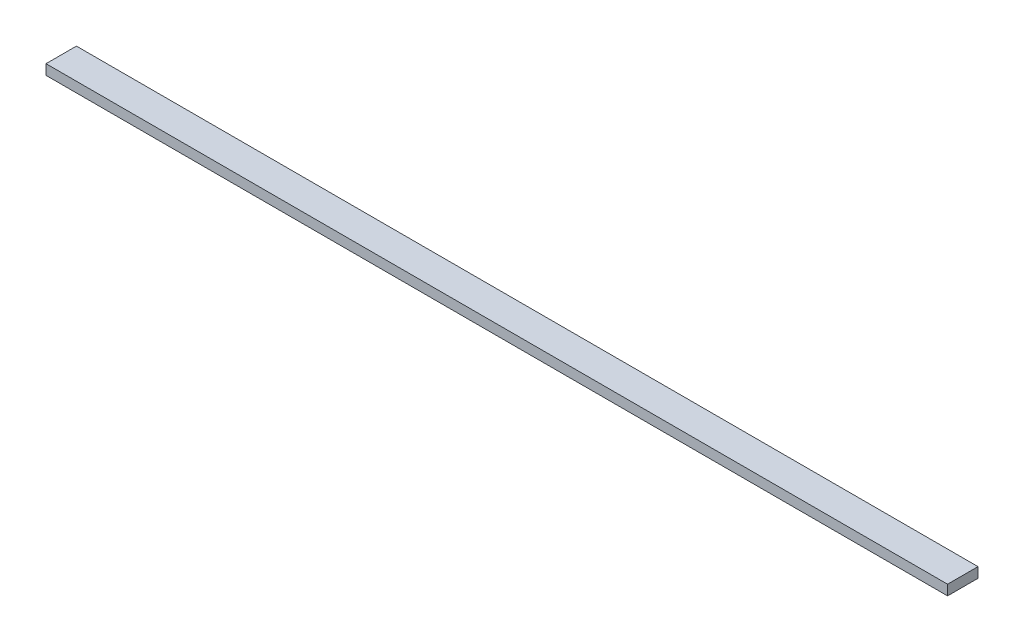
ISO-10303-21;
HEADER;
FILE_DESCRIPTION(('STEP AP214'),'2;1');
FILE_NAME('part.step','',(''),(''),'','','');
FILE_SCHEMA(('AUTOMOTIVE_DESIGN { 1 0 10303 214 1 1 1 1 }'));
ENDSEC;
DATA;
#1=APPLICATION_CONTEXT('core data for automotive mechanical design processes');
#2=APPLICATION_PROTOCOL_DEFINITION('international standard','automotive_design',2000,#1);
#3=PRODUCT_CONTEXT('',#1,'mechanical');
#4=PRODUCT('Part','Part','',(#3));
#5=PRODUCT_RELATED_PRODUCT_CATEGORY('part','',(#4));
#6=PRODUCT_DEFINITION_FORMATION('','',#4);
#7=PRODUCT_DEFINITION_CONTEXT('part definition',#1,'design');
#8=PRODUCT_DEFINITION('design','',#6,#7);
#9=PRODUCT_DEFINITION_SHAPE('','',#8);
#10=(LENGTH_UNIT() NAMED_UNIT(*) SI_UNIT(.MILLI.,.METRE.));
#11=(NAMED_UNIT(*) PLANE_ANGLE_UNIT() SI_UNIT($,.RADIAN.));
#12=(NAMED_UNIT(*) SI_UNIT($,.STERADIAN.) SOLID_ANGLE_UNIT());
#13=UNCERTAINTY_MEASURE_WITH_UNIT(LENGTH_MEASURE(1.E-05),#10,'distance_accuracy_value','');
#14=(GEOMETRIC_REPRESENTATION_CONTEXT(3) GLOBAL_UNCERTAINTY_ASSIGNED_CONTEXT((#13)) GLOBAL_UNIT_ASSIGNED_CONTEXT((#10,
#11,#12)) REPRESENTATION_CONTEXT('',''));
#15=CARTESIAN_POINT('',(0.,0.,0.));
#16=DIRECTION('',(0.,0.,1.));
#17=DIRECTION('',(1.,0.,0.));
#18=AXIS2_PLACEMENT_3D('',#15,#16,#17);
#19=CARTESIAN_POINT('',(-444.265,10.,-15.));
#20=DIRECTION('',(1.,0.,0.));
#21=DIRECTION('',(0.,0.,-1.));
#22=AXIS2_PLACEMENT_3D('',#19,#20,#21);
#23=PLANE('',#22);
#24=DIRECTION('',(0.,0.,1.));
#25=VECTOR('',#24,1.);
#26=CARTESIAN_POINT('',(-444.265,0.,-15.));
#27=LINE('',#26,#25);
#28=CARTESIAN_POINT('',(-444.265,0.,-15.));
#29=VERTEX_POINT('',#28);
#30=CARTESIAN_POINT('',(-444.265,0.,15.));
#31=VERTEX_POINT('',#30);
#32=EDGE_CURVE('E95',#29,#31,#27,.T.);
#33=ORIENTED_EDGE('',*,*,#32,.T.);
#34=DIRECTION('',(0.,-1.,0.));
#35=VECTOR('',#34,1.);
#36=CARTESIAN_POINT('',(-444.265,10.,15.));
#37=LINE('',#36,#35);
#38=CARTESIAN_POINT('',(-444.265,10.,15.));
#39=VERTEX_POINT('',#38);
#40=EDGE_CURVE('E11',#39,#31,#37,.T.);
#41=ORIENTED_EDGE('',*,*,#40,.F.);
#42=DIRECTION('',(0.,0.,1.));
#43=VECTOR('',#42,1.);
#44=CARTESIAN_POINT('',(-444.265,10.,-15.));
#45=LINE('',#44,#43);
#46=CARTESIAN_POINT('',(-444.265,10.,-15.));
#47=VERTEX_POINT('',#46);
#48=EDGE_CURVE('E83',#47,#39,#45,.T.);
#49=ORIENTED_EDGE('',*,*,#48,.F.);
#50=DIRECTION('',(0.,-1.,0.));
#51=VECTOR('',#50,1.);
#52=CARTESIAN_POINT('',(-444.265,10.,-15.));
#53=LINE('',#52,#51);
#54=EDGE_CURVE('E91',#47,#29,#53,.T.);
#55=ORIENTED_EDGE('',*,*,#54,.T.);
#56=EDGE_LOOP('',(#33,#41,#49,#55));
#57=FACE_BOUND('',#56,.T.);
#58=ADVANCED_FACE('F32',(#57),#23,.F.);
#59=CARTESIAN_POINT('',(-444.265,10.,15.));
#60=DIRECTION('',(0.,0.,-1.));
#61=DIRECTION('',(-1.,0.,0.));
#62=AXIS2_PLACEMENT_3D('',#59,#60,#61);
#63=PLANE('',#62);
#64=DIRECTION('',(1.,0.,0.));
#65=VECTOR('',#64,1.);
#66=CARTESIAN_POINT('',(-444.265,0.,15.));
#67=LINE('',#66,#65);
#68=CARTESIAN_POINT('',(444.265,0.,15.));
#69=VERTEX_POINT('',#68);
#70=EDGE_CURVE('E87',#31,#69,#67,.T.);
#71=ORIENTED_EDGE('',*,*,#70,.T.);
#72=DIRECTION('',(0.,-1.,0.));
#73=VECTOR('',#72,1.);
#74=CARTESIAN_POINT('',(444.265,10.,15.));
#75=LINE('',#74,#73);
#76=CARTESIAN_POINT('',(444.265,10.,15.));
#77=VERTEX_POINT('',#76);
#78=EDGE_CURVE('E40',#77,#69,#75,.T.);
#79=ORIENTED_EDGE('',*,*,#78,.F.);
#80=DIRECTION('',(1.,0.,0.));
#81=VECTOR('',#80,1.);
#82=CARTESIAN_POINT('',(-444.265,10.,15.));
#83=LINE('',#82,#81);
#84=EDGE_CURVE('E78',#39,#77,#83,.T.);
#85=ORIENTED_EDGE('',*,*,#84,.F.);
#86=ORIENTED_EDGE('',*,*,#40,.T.);
#87=EDGE_LOOP('',(#71,#79,#85,#86));
#88=FACE_BOUND('',#87,.T.);
#89=ADVANCED_FACE('F86',(#88),#63,.F.);
#90=CARTESIAN_POINT('',(444.265,10.,-15.));
#91=DIRECTION('',(-1.,0.,0.));
#92=DIRECTION('',(0.,0.,1.));
#93=AXIS2_PLACEMENT_3D('',#90,#91,#92);
#94=PLANE('',#93);
#95=DIRECTION('',(0.,0.,-1.));
#96=VECTOR('',#95,1.);
#97=CARTESIAN_POINT('',(444.265,0.,-15.));
#98=LINE('',#97,#96);
#99=CARTESIAN_POINT('',(444.265,0.,-15.));
#100=VERTEX_POINT('',#99);
#101=EDGE_CURVE('E65',#69,#100,#98,.T.);
#102=ORIENTED_EDGE('',*,*,#101,.T.);
#103=DIRECTION('',(0.,-1.,0.));
#104=VECTOR('',#103,1.);
#105=CARTESIAN_POINT('',(444.265,10.,-15.));
#106=LINE('',#105,#104);
#107=CARTESIAN_POINT('',(444.265,10.,-15.));
#108=VERTEX_POINT('',#107);
#109=EDGE_CURVE('E88',#108,#100,#106,.T.);
#110=ORIENTED_EDGE('',*,*,#109,.F.);
#111=DIRECTION('',(0.,0.,-1.));
#112=VECTOR('',#111,1.);
#113=CARTESIAN_POINT('',(444.265,10.,-15.));
#114=LINE('',#113,#112);
#115=EDGE_CURVE('E81',#77,#108,#114,.T.);
#116=ORIENTED_EDGE('',*,*,#115,.F.);
#117=ORIENTED_EDGE('',*,*,#78,.T.);
#118=EDGE_LOOP('',(#102,#110,#116,#117));
#119=FACE_BOUND('',#118,.T.);
#120=ADVANCED_FACE('F89',(#119),#94,.F.);
#121=CARTESIAN_POINT('',(-444.265,10.,-15.));
#122=DIRECTION('',(0.,0.,1.));
#123=DIRECTION('',(1.,0.,0.));
#124=AXIS2_PLACEMENT_3D('',#121,#122,#123);
#125=PLANE('',#124);
#126=DIRECTION('',(-1.,0.,0.));
#127=VECTOR('',#126,1.);
#128=CARTESIAN_POINT('',(-444.265,0.,-15.));
#129=LINE('',#128,#127);
#130=EDGE_CURVE('E71',#100,#29,#129,.T.);
#131=ORIENTED_EDGE('',*,*,#130,.T.);
#132=ORIENTED_EDGE('',*,*,#54,.F.);
#133=DIRECTION('',(-1.,0.,0.));
#134=VECTOR('',#133,1.);
#135=CARTESIAN_POINT('',(-444.265,10.,-15.));
#136=LINE('',#135,#134);
#137=EDGE_CURVE('E48',#108,#47,#136,.T.);
#138=ORIENTED_EDGE('',*,*,#137,.F.);
#139=ORIENTED_EDGE('',*,*,#109,.T.);
#140=EDGE_LOOP('',(#131,#132,#138,#139));
#141=FACE_BOUND('',#140,.T.);
#142=ADVANCED_FACE('F102',(#141),#125,.F.);
#143=CARTESIAN_POINT('',(0.,10.,0.));
#144=DIRECTION('',(0.,1.,0.));
#145=DIRECTION('',(0.,0.,1.));
#146=AXIS2_PLACEMENT_3D('',#143,#144,#145);
#147=PLANE('',#146);
#148=ORIENTED_EDGE('',*,*,#48,.T.);
#149=ORIENTED_EDGE('',*,*,#84,.T.);
#150=ORIENTED_EDGE('',*,*,#115,.T.);
#151=ORIENTED_EDGE('',*,*,#137,.T.);
#152=EDGE_LOOP('',(#148,#149,#150,#151));
#153=FACE_BOUND('',#152,.T.);
#154=ADVANCED_FACE('F79',(#153),#147,.T.);
#155=CARTESIAN_POINT('',(0.,0.,0.));
#156=DIRECTION('',(0.,1.,0.));
#157=DIRECTION('',(0.,0.,1.));
#158=AXIS2_PLACEMENT_3D('',#155,#156,#157);
#159=PLANE('',#158);
#160=ORIENTED_EDGE('',*,*,#32,.F.);
#161=ORIENTED_EDGE('',*,*,#130,.F.);
#162=ORIENTED_EDGE('',*,*,#101,.F.);
#163=ORIENTED_EDGE('',*,*,#70,.F.);
#164=EDGE_LOOP('',(#160,#161,#162,#163));
#165=FACE_BOUND('',#164,.T.);
#166=ADVANCED_FACE('F105',(#165),#159,.F.);
#167=CLOSED_SHELL('',(#58,#89,#120,#142,#154,#166));
#168=MANIFOLD_SOLID_BREP('B2',#167);
#169=ADVANCED_BREP_SHAPE_REPRESENTATION('',(#18,#168),#14);
#170=SHAPE_DEFINITION_REPRESENTATION(#9,#169);
ENDSEC;
END-ISO-10303-21;
